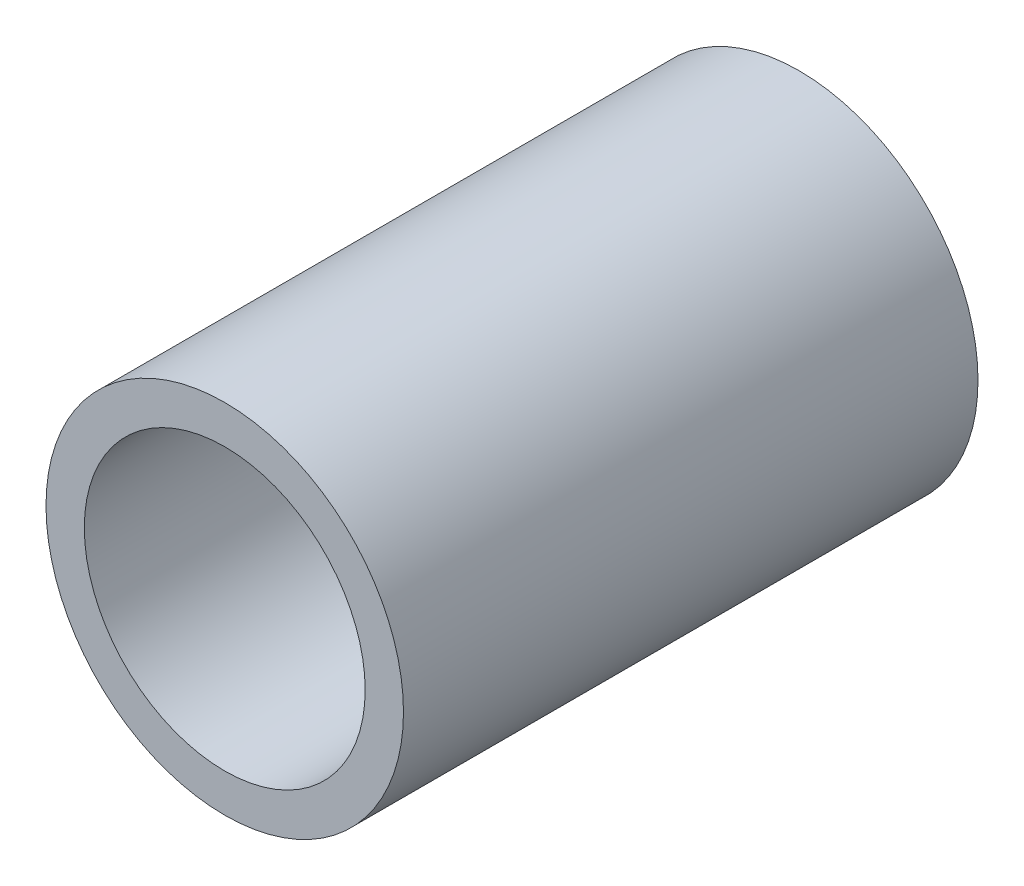
ISO-10303-21;
HEADER;
FILE_DESCRIPTION(('STEP AP214'),'2;1');
FILE_NAME('part.step','',(''),(''),'','','');
FILE_SCHEMA(('AUTOMOTIVE_DESIGN { 1 0 10303 214 1 1 1 1 }'));
ENDSEC;
DATA;
#1=APPLICATION_CONTEXT('core data for automotive mechanical design processes');
#2=APPLICATION_PROTOCOL_DEFINITION('international standard','automotive_design',2000,#1);
#3=PRODUCT_CONTEXT('',#1,'mechanical');
#4=PRODUCT('Part','Part','',(#3));
#5=PRODUCT_RELATED_PRODUCT_CATEGORY('part','',(#4));
#6=PRODUCT_DEFINITION_FORMATION('','',#4);
#7=PRODUCT_DEFINITION_CONTEXT('part definition',#1,'design');
#8=PRODUCT_DEFINITION('design','',#6,#7);
#9=PRODUCT_DEFINITION_SHAPE('','',#8);
#10=(LENGTH_UNIT() NAMED_UNIT(*) SI_UNIT(.MILLI.,.METRE.));
#11=(NAMED_UNIT(*) PLANE_ANGLE_UNIT() SI_UNIT($,.RADIAN.));
#12=(NAMED_UNIT(*) SI_UNIT($,.STERADIAN.) SOLID_ANGLE_UNIT());
#13=UNCERTAINTY_MEASURE_WITH_UNIT(LENGTH_MEASURE(1.E-05),#10,'distance_accuracy_value','');
#14=(GEOMETRIC_REPRESENTATION_CONTEXT(3) GLOBAL_UNCERTAINTY_ASSIGNED_CONTEXT((#13)) GLOBAL_UNIT_ASSIGNED_CONTEXT((#10,
#11,#12)) REPRESENTATION_CONTEXT('',''));
#15=CARTESIAN_POINT('',(0.,0.,0.));
#16=DIRECTION('',(0.,0.,1.));
#17=DIRECTION('',(1.,0.,0.));
#18=AXIS2_PLACEMENT_3D('',#15,#16,#17);
#19=CARTESIAN_POINT('',(0.,0.,45.));
#20=DIRECTION('',(0.,0.,-1.));
#21=DIRECTION('',(-1.,0.,0.));
#22=AXIS2_PLACEMENT_3D('',#19,#20,#21);
#23=CYLINDRICAL_SURFACE('',#22,14.);
#24=CARTESIAN_POINT('',(0.,0.,45.));
#25=DIRECTION('',(0.,0.,1.));
#26=DIRECTION('',(1.,0.,0.));
#27=AXIS2_PLACEMENT_3D('',#24,#25,#26);
#28=CIRCLE('',#27,14.);
#29=CARTESIAN_POINT('',(14.,0.,45.));
#30=VERTEX_POINT('',#29);
#31=EDGE_CURVE('E12',#30,#30,#28,.T.);
#32=ORIENTED_EDGE('',*,*,#31,.F.);
#33=EDGE_LOOP('',(#32));
#34=FACE_BOUND('',#33,.T.);
#35=CARTESIAN_POINT('',(0.,0.,0.));
#36=DIRECTION('',(0.,0.,1.));
#37=DIRECTION('',(1.,0.,0.));
#38=AXIS2_PLACEMENT_3D('',#35,#36,#37);
#39=CIRCLE('',#38,14.);
#40=CARTESIAN_POINT('',(14.,0.,0.));
#41=VERTEX_POINT('',#40);
#42=EDGE_CURVE('E48',#41,#41,#39,.T.);
#43=ORIENTED_EDGE('',*,*,#42,.T.);
#44=EDGE_LOOP('',(#43));
#45=FACE_BOUND('',#44,.T.);
#46=ADVANCED_FACE('F45',(#34,#45),#23,.T.);
#47=CARTESIAN_POINT('',(0.,0.,45.));
#48=DIRECTION('',(0.,0.,1.));
#49=DIRECTION('',(1.,0.,0.));
#50=AXIS2_PLACEMENT_3D('',#47,#48,#49);
#51=PLANE('',#50);
#52=CARTESIAN_POINT('',(0.,0.,45.));
#53=DIRECTION('',(0.,0.,1.));
#54=DIRECTION('',(1.,0.,0.));
#55=AXIS2_PLACEMENT_3D('',#52,#53,#54);
#56=CIRCLE('',#55,11.);
#57=CARTESIAN_POINT('',(11.,0.,45.));
#58=VERTEX_POINT('',#57);
#59=EDGE_CURVE('E57',#58,#58,#56,.T.);
#60=ORIENTED_EDGE('',*,*,#59,.F.);
#61=EDGE_LOOP('',(#60));
#62=FACE_BOUND('',#61,.T.);
#63=ORIENTED_EDGE('',*,*,#31,.T.);
#64=EDGE_LOOP('',(#63));
#65=FACE_BOUND('',#64,.T.);
#66=ADVANCED_FACE('F72',(#62,#65),#51,.T.);
#67=CARTESIAN_POINT('',(0.,0.,0.));
#68=DIRECTION('',(0.,0.,1.));
#69=DIRECTION('',(1.,0.,0.));
#70=AXIS2_PLACEMENT_3D('',#67,#68,#69);
#71=PLANE('',#70);
#72=ORIENTED_EDGE('',*,*,#42,.F.);
#73=EDGE_LOOP('',(#72));
#74=FACE_BOUND('',#73,.T.);
#75=ADVANCED_FACE('F68',(#74),#71,.F.);
#76=CARTESIAN_POINT('',(0.,0.,14.));
#77=DIRECTION('',(0.,0.,1.));
#78=DIRECTION('',(1.,0.,0.));
#79=AXIS2_PLACEMENT_3D('',#76,#77,#78);
#80=CYLINDRICAL_SURFACE('',#79,11.);
#81=CARTESIAN_POINT('',(0.,0.,14.));
#82=DIRECTION('',(0.,0.,1.));
#83=DIRECTION('',(1.,0.,0.));
#84=AXIS2_PLACEMENT_3D('',#81,#82,#83);
#85=CIRCLE('',#84,11.);
#86=CARTESIAN_POINT('',(11.,0.,14.));
#87=VERTEX_POINT('',#86);
#88=EDGE_CURVE('E55',#87,#87,#85,.T.);
#89=ORIENTED_EDGE('',*,*,#88,.F.);
#90=EDGE_LOOP('',(#89));
#91=FACE_BOUND('',#90,.T.);
#92=ORIENTED_EDGE('',*,*,#59,.T.);
#93=EDGE_LOOP('',(#92));
#94=FACE_BOUND('',#93,.T.);
#95=ADVANCED_FACE('F65',(#91,#94),#80,.F.);
#96=CARTESIAN_POINT('',(0.,0.,14.));
#97=DIRECTION('',(0.,0.,1.));
#98=DIRECTION('',(1.,0.,0.));
#99=AXIS2_PLACEMENT_3D('',#96,#97,#98);
#100=PLANE('',#99);
#101=ORIENTED_EDGE('',*,*,#88,.T.);
#102=EDGE_LOOP('',(#101));
#103=FACE_BOUND('',#102,.T.);
#104=ADVANCED_FACE('F63',(#103),#100,.T.);
#105=CLOSED_SHELL('',(#46,#66,#75,#95,#104));
#106=MANIFOLD_SOLID_BREP('B2',#105);
#107=ADVANCED_BREP_SHAPE_REPRESENTATION('',(#18,#106),#14);
#108=SHAPE_DEFINITION_REPRESENTATION(#9,#107);
ENDSEC;
END-ISO-10303-21;
